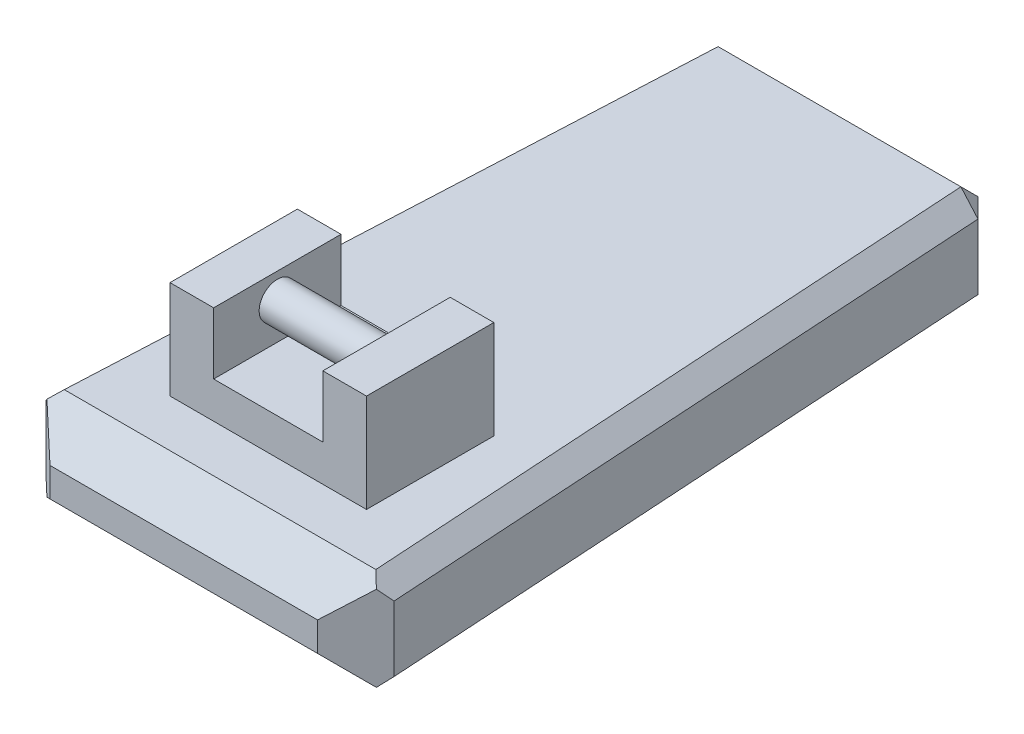
ISO-10303-21;
HEADER;
FILE_DESCRIPTION(('STEP AP214'),'2;1');
FILE_NAME('part.step','',(''),(''),'','','');
FILE_SCHEMA(('AUTOMOTIVE_DESIGN { 1 0 10303 214 1 1 1 1 }'));
ENDSEC;
DATA;
#1=APPLICATION_CONTEXT('core data for automotive mechanical design processes');
#2=APPLICATION_PROTOCOL_DEFINITION('international standard','automotive_design',2000,#1);
#3=PRODUCT_CONTEXT('',#1,'mechanical');
#4=PRODUCT('Part','Part','',(#3));
#5=PRODUCT_RELATED_PRODUCT_CATEGORY('part','',(#4));
#6=PRODUCT_DEFINITION_FORMATION('','',#4);
#7=PRODUCT_DEFINITION_CONTEXT('part definition',#1,'design');
#8=PRODUCT_DEFINITION('design','',#6,#7);
#9=PRODUCT_DEFINITION_SHAPE('','',#8);
#10=(LENGTH_UNIT() NAMED_UNIT(*) SI_UNIT(.MILLI.,.METRE.));
#11=(NAMED_UNIT(*) PLANE_ANGLE_UNIT() SI_UNIT($,.RADIAN.));
#12=(NAMED_UNIT(*) SI_UNIT($,.STERADIAN.) SOLID_ANGLE_UNIT());
#13=UNCERTAINTY_MEASURE_WITH_UNIT(LENGTH_MEASURE(1.E-05),#10,'distance_accuracy_value','');
#14=(GEOMETRIC_REPRESENTATION_CONTEXT(3) GLOBAL_UNCERTAINTY_ASSIGNED_CONTEXT((#13)) GLOBAL_UNIT_ASSIGNED_CONTEXT((#10,
#11,#12)) REPRESENTATION_CONTEXT('',''));
#15=CARTESIAN_POINT('',(0.,0.,0.));
#16=DIRECTION('',(0.,0.,1.));
#17=DIRECTION('',(1.,0.,0.));
#18=AXIS2_PLACEMENT_3D('',#15,#16,#17);
#19=CARTESIAN_POINT('',(27.,35.9415584415584,35.));
#20=DIRECTION('',(-1.,0.,0.));
#21=DIRECTION('',(0.,-1.,0.));
#22=AXIS2_PLACEMENT_3D('',#19,#20,#21);
#23=PLANE('',#22);
#24=DIRECTION('',(0.,1.,0.));
#25=VECTOR('',#24,1.);
#26=CARTESIAN_POINT('',(27.,35.9415584415584,35.));
#27=LINE('',#26,#25);
#28=CARTESIAN_POINT('',(27.,8.94487643859495,35.));
#29=VERTEX_POINT('',#28);
#30=CARTESIAN_POINT('',(27.,35.9415584415584,35.));
#31=VERTEX_POINT('',#30);
#32=EDGE_CURVE('E214',#29,#31,#27,.T.);
#33=ORIENTED_EDGE('',*,*,#32,.F.);
#34=DIRECTION('',(0.,0.,-1.));
#35=VECTOR('',#34,1.);
#36=CARTESIAN_POINT('',(27.,8.94487643859495,35.));
#37=LINE('',#36,#35);
#38=CARTESIAN_POINT('',(27.,8.94487643859495,0.));
#39=VERTEX_POINT('',#38);
#40=EDGE_CURVE('E198',#29,#39,#37,.T.);
#41=ORIENTED_EDGE('',*,*,#40,.T.);
#42=DIRECTION('',(0.,1.,0.));
#43=VECTOR('',#42,1.);
#44=CARTESIAN_POINT('',(27.,35.9415584415584,0.));
#45=LINE('',#44,#43);
#46=CARTESIAN_POINT('',(27.,35.9415584415584,0.));
#47=VERTEX_POINT('',#46);
#48=EDGE_CURVE('E212',#39,#47,#45,.T.);
#49=ORIENTED_EDGE('',*,*,#48,.T.);
#50=DIRECTION('',(0.,0.,-1.));
#51=VECTOR('',#50,1.);
#52=CARTESIAN_POINT('',(27.,35.9415584415584,35.));
#53=LINE('',#52,#51);
#54=EDGE_CURVE('E253',#31,#47,#53,.T.);
#55=ORIENTED_EDGE('',*,*,#54,.F.);
#56=EDGE_LOOP('',(#33,#41,#49,#55));
#57=FACE_BOUND('',#56,.T.);
#58=ADVANCED_FACE('F37',(#57),#23,.F.);
#59=CARTESIAN_POINT('',(15.,35.9415584415584,35.));
#60=DIRECTION('',(0.,-1.,0.));
#61=DIRECTION('',(0.,0.,-1.));
#62=AXIS2_PLACEMENT_3D('',#59,#60,#61);
#63=PLANE('',#62);
#64=DIRECTION('',(-1.,0.,0.));
#65=VECTOR('',#64,1.);
#66=CARTESIAN_POINT('',(15.,35.9415584415584,0.));
#67=LINE('',#66,#65);
#68=CARTESIAN_POINT('',(15.,35.9415584415584,0.));
#69=VERTEX_POINT('',#68);
#70=EDGE_CURVE('E220',#47,#69,#67,.T.);
#71=ORIENTED_EDGE('',*,*,#70,.T.);
#72=DIRECTION('',(0.,0.,-1.));
#73=VECTOR('',#72,1.);
#74=CARTESIAN_POINT('',(15.,35.9415584415584,35.));
#75=LINE('',#74,#73);
#76=CARTESIAN_POINT('',(15.,35.9415584415584,35.));
#77=VERTEX_POINT('',#76);
#78=EDGE_CURVE('E250',#77,#69,#75,.T.);
#79=ORIENTED_EDGE('',*,*,#78,.F.);
#80=DIRECTION('',(-1.,0.,0.));
#81=VECTOR('',#80,1.);
#82=CARTESIAN_POINT('',(15.,35.9415584415584,35.));
#83=LINE('',#82,#81);
#84=EDGE_CURVE('E787',#31,#77,#83,.T.);
#85=ORIENTED_EDGE('',*,*,#84,.F.);
#86=ORIENTED_EDGE('',*,*,#54,.T.);
#87=EDGE_LOOP('',(#71,#79,#85,#86));
#88=FACE_BOUND('',#87,.T.);
#89=ADVANCED_FACE('F483',(#88),#63,.F.);
#90=CARTESIAN_POINT('',(15.,18.9935064935065,35.));
#91=DIRECTION('',(1.,0.,0.));
#92=DIRECTION('',(0.,0.,-1.));
#93=AXIS2_PLACEMENT_3D('',#90,#91,#92);
#94=PLANE('',#93);
#95=CARTESIAN_POINT('',(15.,28.9803110876899,17.5));
#96=DIRECTION('',(1.,0.,0.));
#97=DIRECTION('',(0.,0.,-1.));
#98=AXIS2_PLACEMENT_3D('',#95,#96,#97);
#99=CIRCLE('',#98,5.);
#100=CARTESIAN_POINT('',(15.,28.9803110876899,12.5));
#101=VERTEX_POINT('',#100);
#102=EDGE_CURVE('E207',#101,#101,#99,.F.);
#103=ORIENTED_EDGE('',*,*,#102,.F.);
#104=EDGE_LOOP('',(#103));
#105=FACE_BOUND('',#104,.T.);
#106=DIRECTION('',(0.,-1.,0.));
#107=VECTOR('',#106,1.);
#108=CARTESIAN_POINT('',(15.,18.9935064935065,0.));
#109=LINE('',#108,#107);
#110=CARTESIAN_POINT('',(15.,18.9935064935065,0.));
#111=VERTEX_POINT('',#110);
#112=EDGE_CURVE('E222',#69,#111,#109,.T.);
#113=ORIENTED_EDGE('',*,*,#112,.T.);
#114=DIRECTION('',(0.,0.,-1.));
#115=VECTOR('',#114,1.);
#116=CARTESIAN_POINT('',(15.,18.9935064935065,35.));
#117=LINE('',#116,#115);
#118=CARTESIAN_POINT('',(15.,18.9935064935065,35.));
#119=VERTEX_POINT('',#118);
#120=EDGE_CURVE('E247',#119,#111,#117,.T.);
#121=ORIENTED_EDGE('',*,*,#120,.F.);
#122=DIRECTION('',(0.,-1.,0.));
#123=VECTOR('',#122,1.);
#124=CARTESIAN_POINT('',(15.,18.9935064935065,35.));
#125=LINE('',#124,#123);
#126=EDGE_CURVE('E785',#77,#119,#125,.T.);
#127=ORIENTED_EDGE('',*,*,#126,.F.);
#128=ORIENTED_EDGE('',*,*,#78,.T.);
#129=EDGE_LOOP('',(#113,#121,#127,#128));
#130=FACE_BOUND('',#129,.T.);
#131=ADVANCED_FACE('F488',(#105,#130),#94,.F.);
#132=CARTESIAN_POINT('',(-15.,18.9935064935065,35.));
#133=DIRECTION('',(0.,-1.,0.));
#134=DIRECTION('',(0.,0.,-1.));
#135=AXIS2_PLACEMENT_3D('',#132,#133,#134);
#136=PLANE('',#135);
#137=DIRECTION('',(-1.,0.,0.));
#138=VECTOR('',#137,1.);
#139=CARTESIAN_POINT('',(-15.,18.9935064935065,0.));
#140=LINE('',#139,#138);
#141=CARTESIAN_POINT('',(-15.,18.9935064935065,0.));
#142=VERTEX_POINT('',#141);
#143=EDGE_CURVE('E230',#111,#142,#140,.T.);
#144=ORIENTED_EDGE('',*,*,#143,.T.);
#145=DIRECTION('',(0.,0.,-1.));
#146=VECTOR('',#145,1.);
#147=CARTESIAN_POINT('',(-15.,18.9935064935065,35.));
#148=LINE('',#147,#146);
#149=CARTESIAN_POINT('',(-15.,18.9935064935065,35.));
#150=VERTEX_POINT('',#149);
#151=EDGE_CURVE('E244',#150,#142,#148,.T.);
#152=ORIENTED_EDGE('',*,*,#151,.F.);
#153=DIRECTION('',(-1.,0.,0.));
#154=VECTOR('',#153,1.);
#155=CARTESIAN_POINT('',(-15.,18.9935064935065,35.));
#156=LINE('',#155,#154);
#157=EDGE_CURVE('E770',#119,#150,#156,.T.);
#158=ORIENTED_EDGE('',*,*,#157,.F.);
#159=ORIENTED_EDGE('',*,*,#120,.T.);
#160=EDGE_LOOP('',(#144,#152,#158,#159));
#161=FACE_BOUND('',#160,.T.);
#162=ADVANCED_FACE('F722',(#161),#136,.F.);
#163=CARTESIAN_POINT('',(-15.,18.9935064935065,35.));
#164=DIRECTION('',(-1.,0.,0.));
#165=DIRECTION('',(0.,0.,1.));
#166=AXIS2_PLACEMENT_3D('',#163,#164,#165);
#167=PLANE('',#166);
#168=CARTESIAN_POINT('',(-15.,28.9803110876899,17.5));
#169=DIRECTION('',(-1.,0.,0.));
#170=DIRECTION('',(0.,0.,1.));
#171=AXIS2_PLACEMENT_3D('',#168,#169,#170);
#172=CIRCLE('',#171,5.);
#173=CARTESIAN_POINT('',(-15.,28.9803110876899,22.5));
#174=VERTEX_POINT('',#173);
#175=EDGE_CURVE('E255',#174,#174,#172,.F.);
#176=ORIENTED_EDGE('',*,*,#175,.F.);
#177=EDGE_LOOP('',(#176));
#178=FACE_BOUND('',#177,.T.);
#179=DIRECTION('',(0.,1.,0.));
#180=VECTOR('',#179,1.);
#181=CARTESIAN_POINT('',(-15.,18.9935064935065,0.));
#182=LINE('',#181,#180);
#183=CARTESIAN_POINT('',(-15.,35.9415584415584,0.));
#184=VERTEX_POINT('',#183);
#185=EDGE_CURVE('E232',#142,#184,#182,.T.);
#186=ORIENTED_EDGE('',*,*,#185,.T.);
#187=DIRECTION('',(0.,0.,-1.));
#188=VECTOR('',#187,1.);
#189=CARTESIAN_POINT('',(-15.,35.9415584415584,35.));
#190=LINE('',#189,#188);
#191=CARTESIAN_POINT('',(-15.,35.9415584415584,35.));
#192=VERTEX_POINT('',#191);
#193=EDGE_CURVE('E241',#192,#184,#190,.T.);
#194=ORIENTED_EDGE('',*,*,#193,.F.);
#195=DIRECTION('',(0.,1.,0.));
#196=VECTOR('',#195,1.);
#197=CARTESIAN_POINT('',(-15.,18.9935064935065,35.));
#198=LINE('',#197,#196);
#199=EDGE_CURVE('E781',#150,#192,#198,.T.);
#200=ORIENTED_EDGE('',*,*,#199,.F.);
#201=ORIENTED_EDGE('',*,*,#151,.T.);
#202=EDGE_LOOP('',(#186,#194,#200,#201));
#203=FACE_BOUND('',#202,.T.);
#204=ADVANCED_FACE('F712',(#178,#203),#167,.F.);
#205=CARTESIAN_POINT('',(-15.,35.9415584415584,35.));
#206=DIRECTION('',(0.,-1.,0.));
#207=DIRECTION('',(0.,0.,-1.));
#208=AXIS2_PLACEMENT_3D('',#205,#206,#207);
#209=PLANE('',#208);
#210=DIRECTION('',(-1.,0.,0.));
#211=VECTOR('',#210,1.);
#212=CARTESIAN_POINT('',(-15.,35.9415584415584,0.));
#213=LINE('',#212,#211);
#214=CARTESIAN_POINT('',(-27.,35.9415584415584,0.));
#215=VERTEX_POINT('',#214);
#216=EDGE_CURVE('E234',#184,#215,#213,.T.);
#217=ORIENTED_EDGE('',*,*,#216,.T.);
#218=DIRECTION('',(0.,0.,-1.));
#219=VECTOR('',#218,1.);
#220=CARTESIAN_POINT('',(-27.,35.9415584415584,35.));
#221=LINE('',#220,#219);
#222=CARTESIAN_POINT('',(-27.,35.9415584415584,35.));
#223=VERTEX_POINT('',#222);
#224=EDGE_CURVE('E238',#223,#215,#221,.T.);
#225=ORIENTED_EDGE('',*,*,#224,.F.);
#226=DIRECTION('',(-1.,0.,0.));
#227=VECTOR('',#226,1.);
#228=CARTESIAN_POINT('',(-15.,35.9415584415584,35.));
#229=LINE('',#228,#227);
#230=EDGE_CURVE('E778',#192,#223,#229,.T.);
#231=ORIENTED_EDGE('',*,*,#230,.F.);
#232=ORIENTED_EDGE('',*,*,#193,.T.);
#233=EDGE_LOOP('',(#217,#225,#231,#232));
#234=FACE_BOUND('',#233,.T.);
#235=ADVANCED_FACE('F703',(#234),#209,.F.);
#236=CARTESIAN_POINT('',(-27.,35.9415584415584,35.));
#237=DIRECTION('',(1.,0.,0.));
#238=DIRECTION('',(0.,1.,0.));
#239=AXIS2_PLACEMENT_3D('',#236,#237,#238);
#240=PLANE('',#239);
#241=DIRECTION('',(0.,-1.,0.));
#242=VECTOR('',#241,1.);
#243=CARTESIAN_POINT('',(-27.,35.9415584415584,0.));
#244=LINE('',#243,#242);
#245=CARTESIAN_POINT('',(-27.,8.94487643859495,0.));
#246=VERTEX_POINT('',#245);
#247=EDGE_CURVE('E236',#215,#246,#244,.T.);
#248=ORIENTED_EDGE('',*,*,#247,.T.);
#249=DIRECTION('',(0.,0.,1.));
#250=VECTOR('',#249,1.);
#251=CARTESIAN_POINT('',(-27.,8.94487643859495,35.));
#252=LINE('',#251,#250);
#253=CARTESIAN_POINT('',(-27.,8.94487643859495,35.));
#254=VERTEX_POINT('',#253);
#255=EDGE_CURVE('E201',#246,#254,#252,.T.);
#256=ORIENTED_EDGE('',*,*,#255,.T.);
#257=DIRECTION('',(0.,-1.,0.));
#258=VECTOR('',#257,1.);
#259=CARTESIAN_POINT('',(-27.,35.9415584415584,35.));
#260=LINE('',#259,#258);
#261=EDGE_CURVE('E226',#223,#254,#260,.T.);
#262=ORIENTED_EDGE('',*,*,#261,.F.);
#263=ORIENTED_EDGE('',*,*,#224,.T.);
#264=EDGE_LOOP('',(#248,#256,#262,#263));
#265=FACE_BOUND('',#264,.T.);
#266=ADVANCED_FACE('F694',(#265),#240,.F.);
#267=CARTESIAN_POINT('',(0.,0.,35.));
#268=DIRECTION('',(0.,0.,1.));
#269=DIRECTION('',(1.,0.,0.));
#270=AXIS2_PLACEMENT_3D('',#267,#268,#269);
#271=PLANE('',#270);
#272=DIRECTION('',(-1.,0.,0.));
#273=VECTOR('',#272,1.);
#274=CARTESIAN_POINT('',(0.,8.94487643859495,35.));
#275=LINE('',#274,#273);
#276=EDGE_CURVE('E215',#29,#254,#275,.T.);
#277=ORIENTED_EDGE('',*,*,#276,.F.);
#278=ORIENTED_EDGE('',*,*,#32,.T.);
#279=ORIENTED_EDGE('',*,*,#84,.T.);
#280=ORIENTED_EDGE('',*,*,#126,.T.);
#281=ORIENTED_EDGE('',*,*,#157,.T.);
#282=ORIENTED_EDGE('',*,*,#199,.T.);
#283=ORIENTED_EDGE('',*,*,#230,.T.);
#284=ORIENTED_EDGE('',*,*,#261,.T.);
#285=EDGE_LOOP('',(#277,#278,#279,#280,#281,#282,#283,#284));
#286=FACE_BOUND('',#285,.T.);
#287=ADVANCED_FACE('F686',(#286),#271,.T.);
#288=CARTESIAN_POINT('',(0.,0.,0.));
#289=DIRECTION('',(0.,0.,1.));
#290=DIRECTION('',(1.,0.,0.));
#291=AXIS2_PLACEMENT_3D('',#288,#289,#290);
#292=PLANE('',#291);
#293=ORIENTED_EDGE('',*,*,#48,.F.);
#294=DIRECTION('',(-1.,0.,0.));
#295=VECTOR('',#294,1.);
#296=CARTESIAN_POINT('',(0.,8.94487643859495,0.));
#297=LINE('',#296,#295);
#298=EDGE_CURVE('E195',#39,#246,#297,.T.);
#299=ORIENTED_EDGE('',*,*,#298,.T.);
#300=ORIENTED_EDGE('',*,*,#247,.F.);
#301=ORIENTED_EDGE('',*,*,#216,.F.);
#302=ORIENTED_EDGE('',*,*,#185,.F.);
#303=ORIENTED_EDGE('',*,*,#143,.F.);
#304=ORIENTED_EDGE('',*,*,#112,.F.);
#305=ORIENTED_EDGE('',*,*,#70,.F.);
#306=EDGE_LOOP('',(#293,#299,#300,#301,#302,#303,#304,#305));
#307=FACE_BOUND('',#306,.T.);
#308=ADVANCED_FACE('F218',(#307),#292,.F.);
#309=CARTESIAN_POINT('',(20.,28.9803110876899,17.5));
#310=DIRECTION('',(-1.,0.,0.));
#311=DIRECTION('',(0.,0.,1.));
#312=AXIS2_PLACEMENT_3D('',#309,#310,#311);
#313=CYLINDRICAL_SURFACE('',#312,5.);
#314=ORIENTED_EDGE('',*,*,#175,.T.);
#315=EDGE_LOOP('',(#314));
#316=FACE_BOUND('',#315,.T.);
#317=ORIENTED_EDGE('',*,*,#102,.T.);
#318=EDGE_LOOP('',(#317));
#319=FACE_BOUND('',#318,.T.);
#320=ADVANCED_FACE('F670',(#316,#319),#313,.T.);
#321=CARTESIAN_POINT('',(52.6007233275502,-19.0370940272118,58.));
#322=DIRECTION('',(0.,-1.,0.));
#323=DIRECTION('',(0.,0.,-1.));
#324=AXIS2_PLACEMENT_3D('',#321,#322,#323);
#325=PLANE('',#324);
#326=DIRECTION('',(1.,0.,0.));
#327=VECTOR('',#326,1.);
#328=CARTESIAN_POINT('',(36.5697571220703,-19.0370940272118,-123.472786639216));
#329=LINE('',#328,#327);
#330=CARTESIAN_POINT('',(-34.8507689927314,-19.0370940272118,-123.472786639216));
#331=VERTEX_POINT('',#330);
#332=CARTESIAN_POINT('',(31.8718862353731,-19.0370940272118,-123.472786639216));
#333=VERTEX_POINT('',#332);
#334=EDGE_CURVE('E318',#331,#333,#329,.T.);
#335=ORIENTED_EDGE('',*,*,#334,.T.);
#336=DIRECTION('',(0.0622479222512534,0.,0.998060717679742));
#337=VECTOR('',#336,1.);
#338=CARTESIAN_POINT('',(42.5858623699172,-19.0370940272118,48.3112396112563));
#339=LINE('',#338,#337);
#340=CARTESIAN_POINT('',(42.5664507060978,-19.0370940272118,48.));
#341=VERTEX_POINT('',#340);
#342=EDGE_CURVE('E320',#333,#341,#339,.T.);
#343=ORIENTED_EDGE('',*,*,#342,.T.);
#344=DIRECTION('',(-1.,0.,0.));
#345=VECTOR('',#344,1.);
#346=CARTESIAN_POINT('',(-47.5406842586914,-19.0370940272118,48.));
#347=LINE('',#346,#345);
#348=CARTESIAN_POINT('',(-43.0558460636915,-19.0370940272118,48.));
#349=VERTEX_POINT('',#348);
#350=EDGE_CURVE('E270',#341,#349,#347,.T.);
#351=ORIENTED_EDGE('',*,*,#350,.T.);
#352=DIRECTION('',(0.0477959204418131,0.,-0.998857121909395));
#353=VECTOR('',#352,1.);
#354=CARTESIAN_POINT('',(-34.6229512726959,-19.0370940272118,-128.233807037007));
#355=LINE('',#354,#353);
#356=EDGE_CURVE('E316',#349,#331,#355,.T.);
#357=ORIENTED_EDGE('',*,*,#356,.T.);
#358=EDGE_LOOP('',(#335,#343,#351,#357));
#359=FACE_BOUND('',#358,.T.);
#360=ADVANCED_FACE('F394',(#359),#325,.T.);
#361=CARTESIAN_POINT('',(52.6007233275502,8.94487643859495,58.));
#362=DIRECTION('',(0.,1.,0.));
#363=DIRECTION('',(0.,0.,1.));
#364=AXIS2_PLACEMENT_3D('',#361,#362,#363);
#365=PLANE('',#364);
#366=DIRECTION('',(1.,0.,0.));
#367=VECTOR('',#366,1.);
#368=CARTESIAN_POINT('',(47.0835622946655,8.94487643859495,48.));
#369=LINE('',#368,#367);
#370=CARTESIAN_POINT('',(-43.0558460636915,8.94487643859495,48.));
#371=VERTEX_POINT('',#370);
#372=CARTESIAN_POINT('',(42.5664507060978,8.94487643859495,48.));
#373=VERTEX_POINT('',#372);
#374=EDGE_CURVE('E276',#371,#373,#369,.T.);
#375=ORIENTED_EDGE('',*,*,#374,.T.);
#376=DIRECTION('',(-0.0622479222512534,0.,-0.998060717679742));
#377=VECTOR('',#376,1.);
#378=CARTESIAN_POINT('',(31.5794535336716,8.94487643859495,-128.16154702796));
#379=LINE('',#378,#377);
#380=CARTESIAN_POINT('',(31.8718862353732,8.94487643859495,-123.472786639216));
#381=VERTEX_POINT('',#380);
#382=EDGE_CURVE('E11',#373,#381,#379,.T.);
#383=ORIENTED_EDGE('',*,*,#382,.T.);
#384=DIRECTION('',(-1.,0.,0.));
#385=VECTOR('',#384,1.);
#386=CARTESIAN_POINT('',(-39.6172368822429,8.94487643859495,-123.472786639216));
#387=LINE('',#386,#385);
#388=CARTESIAN_POINT('',(-34.8507689927314,8.94487643859495,-123.472786639216));
#389=VERTEX_POINT('',#388);
#390=EDGE_CURVE('E46',#381,#389,#387,.T.);
#391=ORIENTED_EDGE('',*,*,#390,.T.);
#392=DIRECTION('',(-0.0477959204418131,0.,0.998857121909395));
#393=VECTOR('',#392,1.);
#394=CARTESIAN_POINT('',(-43.0672813829217,8.94487643859495,48.2389796022091));
#395=LINE('',#394,#393);
#396=EDGE_CURVE('E346',#389,#371,#395,.T.);
#397=ORIENTED_EDGE('',*,*,#396,.T.);
#398=EDGE_LOOP('',(#375,#383,#391,#397));
#399=FACE_BOUND('',#398,.T.);
#400=ORIENTED_EDGE('',*,*,#40,.F.);
#401=ORIENTED_EDGE('',*,*,#276,.T.);
#402=ORIENTED_EDGE('',*,*,#255,.F.);
#403=ORIENTED_EDGE('',*,*,#298,.F.);
#404=EDGE_LOOP('',(#400,#401,#402,#403));
#405=FACE_BOUND('',#404,.T.);
#406=ADVANCED_FACE('F197',(#399,#405),#365,.T.);
#407=CARTESIAN_POINT('',(0.,0.,58.));
#408=DIRECTION('',(0.,0.,-1.));
#409=DIRECTION('',(-1.,0.,0.));
#410=AXIS2_PLACEMENT_3D('',#407,#408,#409);
#411=PLANE('',#410);
#412=DIRECTION('',(1.,0.,0.));
#413=VECTOR('',#412,1.);
#414=CARTESIAN_POINT('',(47.0835622946655,-9.03709402721181,58.));
#415=LINE('',#414,#413);
#416=CARTESIAN_POINT('',(-36.9768770279031,-9.03709402721181,58.));
#417=VERTEX_POINT('',#416);
#418=CARTESIAN_POINT('',(36.552681690978,-9.03709402721181,58.));
#419=VERTEX_POINT('',#418);
#420=EDGE_CURVE('E262',#417,#419,#415,.T.);
#421=ORIENTED_EDGE('',*,*,#420,.T.);
#422=DIRECTION('',(0.,1.,0.));
#423=VECTOR('',#422,1.);
#424=CARTESIAN_POINT('',(36.552681690978,0.,58.));
#425=LINE('',#424,#423);
#426=CARTESIAN_POINT('',(36.552681690978,-1.05512356140506,58.));
#427=VERTEX_POINT('',#426);
#428=EDGE_CURVE('E264',#419,#427,#425,.T.);
#429=ORIENTED_EDGE('',*,*,#428,.T.);
#430=DIRECTION('',(-1.,0.,0.));
#431=VECTOR('',#430,1.);
#432=CARTESIAN_POINT('',(-47.5406842586914,-1.05512356140506,58.));
#433=LINE('',#432,#431);
#434=CARTESIAN_POINT('',(-36.9768770279031,-1.05512356140506,58.));
#435=VERTEX_POINT('',#434);
#436=EDGE_CURVE('E206',#427,#435,#433,.T.);
#437=ORIENTED_EDGE('',*,*,#436,.T.);
#438=DIRECTION('',(0.,-1.,0.));
#439=VECTOR('',#438,1.);
#440=CARTESIAN_POINT('',(-36.9768770279031,0.,58.));
#441=LINE('',#440,#439);
#442=EDGE_CURVE('E260',#435,#417,#441,.T.);
#443=ORIENTED_EDGE('',*,*,#442,.T.);
#444=EDGE_LOOP('',(#421,#429,#437,#443));
#445=FACE_BOUND('',#444,.T.);
#446=ADVANCED_FACE('F416',(#445),#411,.F.);
#447=CARTESIAN_POINT('',(52.6007233275502,-157.055123561405,-54.));
#448=DIRECTION('',(-0.998788911812763,0.,-0.0492007077172383));
#449=DIRECTION('',(-0.0492007077172383,0.,0.998788911812763));
#450=AXIS2_PLACEMENT_3D('',#447,#448,#449);
#451=PLANE('',#450);
#452=DIRECTION('',(0.,-1.,0.));
#453=VECTOR('',#452,1.);
#454=CARTESIAN_POINT('',(47.5755693718379,-157.055123561405,48.0121108818724));
#455=LINE('',#454,#453);
#456=CARTESIAN_POINT('',(47.5755693718379,3.94622574535658,48.0121108818724));
#457=VERTEX_POINT('',#456);
#458=CARTESIAN_POINT('',(47.5755693718379,-14.0384433339734,48.0121108818724));
#459=VERTEX_POINT('',#458);
#460=EDGE_CURVE('E267',#457,#459,#455,.T.);
#461=ORIENTED_EDGE('',*,*,#460,.T.);
#462=DIRECTION('',(0.0488988877091493,0.110595198266023,-0.992661876421829));
#463=VECTOR('',#462,1.);
#464=CARTESIAN_POINT('',(50.0329630743904,-8.48052665153289,-1.87370775662603));
#465=LINE('',#464,#463);
#466=CARTESIAN_POINT('',(47.576165958316,-14.0370940272118,48.0000000000001));
#467=VERTEX_POINT('',#466);
#468=EDGE_CURVE('E332',#459,#467,#465,.T.);
#469=ORIENTED_EDGE('',*,*,#468,.T.);
#470=DIRECTION('',(0.,1.,0.));
#471=VECTOR('',#470,1.);
#472=CARTESIAN_POINT('',(47.576165958316,-157.055123561405,48.0000000000001));
#473=LINE('',#472,#471);
#474=CARTESIAN_POINT('',(47.576165958316,3.94487643859498,48.0000000000001));
#475=VERTEX_POINT('',#474);
#476=EDGE_CURVE('E291',#467,#475,#473,.T.);
#477=ORIENTED_EDGE('',*,*,#476,.T.);
#478=DIRECTION('',(-0.0488988877091493,0.110595198266023,0.992661876421829));
#479=VECTOR('',#478,1.);
#480=CARTESIAN_POINT('',(50.0329630743904,-1.61169093708394,-1.87370775662603));
#481=LINE('',#480,#479);
#482=EDGE_CURVE('E330',#475,#457,#481,.T.);
#483=ORIENTED_EDGE('',*,*,#482,.T.);
#484=EDGE_LOOP('',(#461,#469,#477,#483));
#485=FACE_BOUND('',#484,.T.);
#486=ADVANCED_FACE('F466',(#485),#451,.F.);
#487=CARTESIAN_POINT('',(-47.5406842586914,-157.055123561405,58.));
#488=DIRECTION('',(0.998646160182909,0.,-0.0520177541992306));
#489=DIRECTION('',(-0.0520177541992306,0.,-0.998646160182909));
#490=AXIS2_PLACEMENT_3D('',#487,#488,#489);
#491=PLANE('',#490);
#492=DIRECTION('',(0.,-1.,0.));
#493=VECTOR('',#492,1.);
#494=CARTESIAN_POINT('',(-48.0615669924687,-157.055123561405,48.));
#495=LINE('',#494,#493);
#496=CARTESIAN_POINT('',(-48.0615669924687,3.94487643859498,48.));
#497=VERTEX_POINT('',#496);
#498=CARTESIAN_POINT('',(-48.0615669924687,-14.0370940272118,48.));
#499=VERTEX_POINT('',#498);
#500=EDGE_CURVE('E278',#497,#499,#495,.T.);
#501=ORIENTED_EDGE('',*,*,#500,.T.);
#502=DIRECTION('',(0.0517611887203937,-0.0991978213053763,0.993720570175801));
#503=VECTOR('',#502,1.);
#504=CARTESIAN_POINT('',(-50.6364499666509,-9.10245501544306,-1.43306443486201));
#505=LINE('',#504,#503);
#506=CARTESIAN_POINT('',(-48.0608618006837,-14.0384454932505,48.0135383981709));
#507=VERTEX_POINT('',#506);
#508=EDGE_CURVE('E336',#499,#507,#505,.T.);
#509=ORIENTED_EDGE('',*,*,#508,.T.);
#510=DIRECTION('',(0.,1.,0.));
#511=VECTOR('',#510,1.);
#512=CARTESIAN_POINT('',(-48.0608618006837,-157.055123561405,48.0135383981709));
#513=LINE('',#512,#511);
#514=CARTESIAN_POINT('',(-48.0608618006837,3.94622790463364,48.0135383981709));
#515=VERTEX_POINT('',#514);
#516=EDGE_CURVE('E273',#507,#515,#513,.T.);
#517=ORIENTED_EDGE('',*,*,#516,.T.);
#518=DIRECTION('',(-0.0517611887203937,-0.0991978213053762,-0.993720570175801));
#519=VECTOR('',#518,1.);
#520=CARTESIAN_POINT('',(-50.6364499666509,-0.989762573173764,-1.43306443486201));
#521=LINE('',#520,#519);
#522=EDGE_CURVE('E334',#515,#497,#521,.T.);
#523=ORIENTED_EDGE('',*,*,#522,.T.);
#524=EDGE_LOOP('',(#501,#509,#517,#523));
#525=FACE_BOUND('',#524,.T.);
#526=ADVANCED_FACE('F430',(#525),#491,.F.);
#527=CARTESIAN_POINT('',(-36.9768770279031,0.,58.));
#528=DIRECTION('',(0.669367365134873,0.,-0.742931578607611));
#529=DIRECTION('',(0.,-1.,0.));
#530=AXIS2_PLACEMENT_3D('',#527,#528,#529);
#531=PLANE('',#530);
#532=ORIENTED_EDGE('',*,*,#516,.F.);
#533=DIRECTION('',(-0.587487173336424,0.612114839132101,-0.529314882541065));
#534=VECTOR('',#533,1.);
#535=CARTESIAN_POINT('',(-46.1782351675235,-15.9999924869629,49.7097495503916));
#536=LINE('',#535,#534);
#537=CARTESIAN_POINT('',(-45.4950548948032,-16.7118119133506,50.3252821138613));
#538=VERTEX_POINT('',#537);
#539=EDGE_CURVE('E340',#507,#538,#536,.F.);
#540=ORIENTED_EDGE('',*,*,#539,.T.);
#541=DIRECTION('',(-0.617385804138295,-0.556252985991317,-0.556252985991315));
#542=VECTOR('',#541,1.);
#543=CARTESIAN_POINT('',(-33.873333823488,-6.24086003051587,60.796233996696));
#544=LINE('',#543,#542);
#545=EDGE_CURVE('E286',#417,#538,#544,.T.);
#546=ORIENTED_EDGE('',*,*,#545,.F.);
#547=ORIENTED_EDGE('',*,*,#442,.F.);
#548=DIRECTION('',(-0.617385804138295,0.556252985991317,-0.556252985991315));
#549=VECTOR('',#548,1.);
#550=CARTESIAN_POINT('',(-9.70146422363249,-25.6297569832042,82.5746334217991));
#551=LINE('',#550,#549);
#552=CARTESIAN_POINT('',(-45.4950548948032,6.6195943247337,50.3252821138613));
#553=VERTEX_POINT('',#552);
#554=EDGE_CURVE('E284',#553,#435,#551,.F.);
#555=ORIENTED_EDGE('',*,*,#554,.F.);
#556=DIRECTION('',(0.587487173336424,0.6121148391321,0.529314882541066));
#557=VECTOR('',#556,1.);
#558=CARTESIAN_POINT('',(-42.5489766698473,9.68917316932027,52.9796431286614));
#559=LINE('',#558,#557);
#560=EDGE_CURVE('E338',#553,#515,#559,.F.);
#561=ORIENTED_EDGE('',*,*,#560,.T.);
#562=EDGE_LOOP('',(#532,#540,#546,#547,#555,#561));
#563=FACE_BOUND('',#562,.T.);
#564=ADVANCED_FACE('F472',(#563),#531,.F.);
#565=CARTESIAN_POINT('',(52.6007233275502,-19.0370940272118,48.));
#566=DIRECTION('',(0.,-0.707106781186546,0.707106781186548));
#567=DIRECTION('',(1.,0.,0.));
#568=AXIS2_PLACEMENT_3D('',#565,#566,#567);
#569=PLANE('',#568);
#570=ORIENTED_EDGE('',*,*,#350,.F.);
#571=DIRECTION('',(0.601319619658374,0.564984386958573,0.564984386958572));
#572=VECTOR('',#571,1.);
#573=CARTESIAN_POINT('',(46.1946960315538,-15.6280884103609,51.409005616851));
#574=LINE('',#573,#572);
#575=CARTESIAN_POINT('',(45.0321540431219,-16.7203828427643,50.3167111844476));
#576=VERTEX_POINT('',#575);
#577=EDGE_CURVE('E324',#341,#576,#574,.T.);
#578=ORIENTED_EDGE('',*,*,#577,.T.);
#579=DIRECTION('',(0.615218515173656,-0.557452320197667,-0.557452320197665));
#580=VECTOR('',#579,1.);
#581=CARTESIAN_POINT('',(49.4858660704331,-20.7559117514093,46.2811822758026));
#582=LINE('',#581,#580);
#583=EDGE_CURVE('E281',#419,#576,#582,.T.);
#584=ORIENTED_EDGE('',*,*,#583,.F.);
#585=ORIENTED_EDGE('',*,*,#420,.F.);
#586=ORIENTED_EDGE('',*,*,#545,.T.);
#587=DIRECTION('',(0.595751526179241,-0.567926103932152,-0.56792610393215));
#588=VECTOR('',#587,1.);
#589=CARTESIAN_POINT('',(-9.10542784375486,-51.4018096833739,15.635284343838));
#590=LINE('',#589,#588);
#591=EDGE_CURVE('E322',#538,#349,#590,.T.);
#592=ORIENTED_EDGE('',*,*,#591,.T.);
#593=EDGE_LOOP('',(#570,#578,#584,#585,#586,#592));
#594=FACE_BOUND('',#593,.T.);
#595=ADVANCED_FACE('F407',(#594),#569,.T.);
#596=CARTESIAN_POINT('',(52.6007233275502,8.94487643859495,48.));
#597=DIRECTION('',(0.,0.707106781186546,0.707106781186548));
#598=DIRECTION('',(-1.,0.,0.));
#599=AXIS2_PLACEMENT_3D('',#596,#597,#598);
#600=PLANE('',#599);
#601=DIRECTION('',(-0.615218515173656,-0.557452320197667,0.557452320197665));
#602=VECTOR('',#601,1.);
#603=CARTESIAN_POINT('',(49.4858660704331,10.6636941627924,46.2811822758026));
#604=LINE('',#603,#602);
#605=CARTESIAN_POINT('',(45.0321540431219,6.62816525414745,50.3167111844475));
#606=VERTEX_POINT('',#605);
#607=EDGE_CURVE('E279',#606,#427,#604,.T.);
#608=ORIENTED_EDGE('',*,*,#607,.F.);
#609=DIRECTION('',(-0.601319619658375,0.564984386958573,-0.564984386958572));
#610=VECTOR('',#609,1.);
#611=CARTESIAN_POINT('',(46.1946960315538,5.53587082174399,51.409005616851));
#612=LINE('',#611,#610);
#613=EDGE_CURVE('E344',#606,#373,#612,.T.);
#614=ORIENTED_EDGE('',*,*,#613,.T.);
#615=ORIENTED_EDGE('',*,*,#374,.F.);
#616=DIRECTION('',(-0.595751526179242,-0.567926103932151,0.56792610393215));
#617=VECTOR('',#616,1.);
#618=CARTESIAN_POINT('',(-9.10542784375481,41.3095920947571,15.635284343838));
#619=LINE('',#618,#617);
#620=EDGE_CURVE('E342',#371,#553,#619,.T.);
#621=ORIENTED_EDGE('',*,*,#620,.T.);
#622=ORIENTED_EDGE('',*,*,#554,.T.);
#623=ORIENTED_EDGE('',*,*,#436,.F.);
#624=EDGE_LOOP('',(#608,#614,#615,#621,#622,#623));
#625=FACE_BOUND('',#624,.T.);
#626=ADVANCED_FACE('F470',(#625),#600,.T.);
#627=CARTESIAN_POINT('',(36.552681690978,0.,58.));
#628=DIRECTION('',(-0.671460258450701,0.,-0.741040566582773));
#629=DIRECTION('',(0.,1.,0.));
#630=AXIS2_PLACEMENT_3D('',#627,#628,#629);
#631=PLANE('',#630);
#632=ORIENTED_EDGE('',*,*,#583,.T.);
#633=DIRECTION('',(-0.583915395925889,-0.615717673965373,0.529088420178879));
#634=VECTOR('',#633,1.);
#635=CARTESIAN_POINT('',(45.7787492229458,-15.9331252182483,49.6402178654457));
#636=LINE('',#635,#634);
#637=EDGE_CURVE('E328',#576,#459,#636,.F.);
#638=ORIENTED_EDGE('',*,*,#637,.T.);
#639=ORIENTED_EDGE('',*,*,#460,.F.);
#640=DIRECTION('',(0.58391539592589,-0.615717673965373,-0.529088420178879));
#641=VECTOR('',#640,1.);
#642=CARTESIAN_POINT('',(42.1503242135339,9.66695061897649,52.9279504194456));
#643=LINE('',#642,#641);
#644=EDGE_CURVE('E326',#457,#606,#643,.F.);
#645=ORIENTED_EDGE('',*,*,#644,.T.);
#646=ORIENTED_EDGE('',*,*,#607,.T.);
#647=ORIENTED_EDGE('',*,*,#428,.F.);
#648=EDGE_LOOP('',(#632,#638,#639,#645,#646,#647));
#649=FACE_BOUND('',#648,.T.);
#650=ADVANCED_FACE('F411',(#649),#631,.F.);
#651=CARTESIAN_POINT('',(44.4097117626053,-157.055123561405,-2.76978367751598));
#652=DIRECTION('',(-0.998060717679742,0.,0.0622479222512534));
#653=DIRECTION('',(0.0622479222512534,0.,0.998060717679742));
#654=AXIS2_PLACEMENT_3D('',#651,#652,#653);
#655=PLANE('',#654);
#656=ORIENTED_EDGE('',*,*,#476,.F.);
#657=DIRECTION('',(-0.0622479222512534,0.,-0.998060717679742));
#658=VECTOR('',#657,1.);
#659=CARTESIAN_POINT('',(36.5697571220703,-14.0370940272118,-128.472786639216));
#660=LINE('',#659,#658);
#661=CARTESIAN_POINT('',(36.9023445933858,-14.0370940272118,-123.140199167901));
#662=VERTEX_POINT('',#661);
#663=EDGE_CURVE('E299',#467,#662,#660,.T.);
#664=ORIENTED_EDGE('',*,*,#663,.T.);
#665=DIRECTION('',(0.,1.,0.));
#666=VECTOR('',#665,1.);
#667=CARTESIAN_POINT('',(36.9023445933858,-157.055123561405,-123.140199167901));
#668=LINE('',#667,#666);
#669=CARTESIAN_POINT('',(36.9023445933858,3.94487643859498,-123.140199167901));
#670=VERTEX_POINT('',#669);
#671=EDGE_CURVE('E296',#662,#670,#668,.T.);
#672=ORIENTED_EDGE('',*,*,#671,.T.);
#673=DIRECTION('',(0.0622479222512534,0.,0.998060717679742));
#674=VECTOR('',#673,1.);
#675=CARTESIAN_POINT('',(47.576165958316,3.94487643859498,48.));
#676=LINE('',#675,#674);
#677=EDGE_CURVE('E294',#670,#475,#676,.T.);
#678=ORIENTED_EDGE('',*,*,#677,.T.);
#679=EDGE_LOOP('',(#656,#664,#672,#678));
#680=FACE_BOUND('',#679,.T.);
#681=ADVANCED_FACE('F464',(#680),#655,.F.);
#682=CARTESIAN_POINT('',(0.,-157.055123561405,-128.472786639216));
#683=DIRECTION('',(0.,0.,1.));
#684=DIRECTION('',(1.,0.,0.));
#685=AXIS2_PLACEMENT_3D('',#682,#683,#684);
#686=PLANE('',#685);
#687=DIRECTION('',(0.,-1.,0.));
#688=VECTOR('',#687,1.);
#689=CARTESIAN_POINT('',(31.5697571220703,-157.055123561405,-128.472786639216));
#690=LINE('',#689,#688);
#691=CARTESIAN_POINT('',(31.5697571220703,3.94487643859498,-128.472786639216));
#692=VERTEX_POINT('',#691);
#693=CARTESIAN_POINT('',(31.5697571220703,-14.0370940272118,-128.472786639216));
#694=VERTEX_POINT('',#693);
#695=EDGE_CURVE('E305',#692,#694,#690,.T.);
#696=ORIENTED_EDGE('',*,*,#695,.T.);
#697=DIRECTION('',(-1.,0.,0.));
#698=VECTOR('',#697,1.);
#699=CARTESIAN_POINT('',(-39.6172368822429,-14.0370940272118,-128.472786639216));
#700=LINE('',#699,#698);
#701=CARTESIAN_POINT('',(-34.3599516599202,-14.0370940272118,-128.472786639216));
#702=VERTEX_POINT('',#701);
#703=EDGE_CURVE('E308',#694,#702,#700,.T.);
#704=ORIENTED_EDGE('',*,*,#703,.T.);
#705=DIRECTION('',(0.,1.,0.));
#706=VECTOR('',#705,1.);
#707=CARTESIAN_POINT('',(-34.3599516599202,-157.055123561405,-128.472786639216));
#708=LINE('',#707,#706);
#709=CARTESIAN_POINT('',(-34.3599516599202,3.94487643859498,-128.472786639216));
#710=VERTEX_POINT('',#709);
#711=EDGE_CURVE('E303',#702,#710,#708,.T.);
#712=ORIENTED_EDGE('',*,*,#711,.T.);
#713=DIRECTION('',(1.,0.,0.));
#714=VECTOR('',#713,1.);
#715=CARTESIAN_POINT('',(36.5697571220703,3.94487643859498,-128.472786639216));
#716=LINE('',#715,#714);
#717=EDGE_CURVE('E301',#710,#692,#716,.T.);
#718=ORIENTED_EDGE('',*,*,#717,.T.);
#719=EDGE_LOOP('',(#696,#704,#712,#718));
#720=FACE_BOUND('',#719,.T.);
#721=ADVANCED_FACE('F449',(#720),#686,.F.);
#722=CARTESIAN_POINT('',(-45.6601905597169,-157.055123561405,-2.18486787297314));
#723=DIRECTION('',(0.998857121909395,0.,0.0477959204418131));
#724=DIRECTION('',(0.0477959204418131,0.,-0.998857121909395));
#725=AXIS2_PLACEMENT_3D('',#722,#723,#724);
#726=PLANE('',#725);
#727=DIRECTION('',(0.,-1.,0.));
#728=VECTOR('',#727,1.);
#729=CARTESIAN_POINT('',(-39.856216484452,-157.055123561405,-123.478501029669));
#730=LINE('',#729,#728);
#731=CARTESIAN_POINT('',(-39.856216484452,3.94487643859498,-123.478501029669));
#732=VERTEX_POINT('',#731);
#733=CARTESIAN_POINT('',(-39.856216484452,-14.0370940272118,-123.478501029669));
#734=VERTEX_POINT('',#733);
#735=EDGE_CURVE('E312',#732,#734,#730,.T.);
#736=ORIENTED_EDGE('',*,*,#735,.T.);
#737=DIRECTION('',(-0.0477959204418131,0.,0.998857121909395));
#738=VECTOR('',#737,1.);
#739=CARTESIAN_POINT('',(-48.0615669924687,-14.0370940272118,48.));
#740=LINE('',#739,#738);
#741=EDGE_CURVE('E314',#734,#499,#740,.T.);
#742=ORIENTED_EDGE('',*,*,#741,.T.);
#743=ORIENTED_EDGE('',*,*,#500,.F.);
#744=DIRECTION('',(0.0477959204418131,0.,-0.998857121909395));
#745=VECTOR('',#744,1.);
#746=CARTESIAN_POINT('',(-39.6172368822429,3.94487643859498,-128.472786639216));
#747=LINE('',#746,#745);
#748=EDGE_CURVE('E310',#497,#732,#747,.T.);
#749=ORIENTED_EDGE('',*,*,#748,.T.);
#750=EDGE_LOOP('',(#736,#742,#743,#749));
#751=FACE_BOUND('',#750,.T.);
#752=ADVANCED_FACE('F427',(#751),#726,.F.);
#753=CARTESIAN_POINT('',(-45.6601905597169,-14.0370940272118,-2.18486787297314));
#754=DIRECTION('',(-0.706298644338608,-0.707106781186551,-0.0337968194574586));
#755=DIRECTION('',(0.0477959204418131,0.,-0.998857121909395));
#756=AXIS2_PLACEMENT_3D('',#753,#754,#755);
#757=PLANE('',#756);
#758=ORIENTED_EDGE('',*,*,#508,.F.);
#759=ORIENTED_EDGE('',*,*,#741,.F.);
#760=DIRECTION('',(-0.707491431664432,0.70672145980423,-0.000807696472576664));
#761=VECTOR('',#760,1.);
#762=CARTESIAN_POINT('',(-39.856216484452,-14.0370940272118,-123.478501029669));
#763=LINE('',#762,#761);
#764=EDGE_CURVE('E376',#331,#734,#763,.T.);
#765=ORIENTED_EDGE('',*,*,#764,.F.);
#766=ORIENTED_EDGE('',*,*,#356,.F.);
#767=ORIENTED_EDGE('',*,*,#591,.F.);
#768=ORIENTED_EDGE('',*,*,#539,.F.);
#769=EDGE_LOOP('',(#758,#759,#765,#766,#767,#768));
#770=FACE_BOUND('',#769,.T.);
#771=ADVANCED_FACE('F39',(#770),#757,.T.);
#772=CARTESIAN_POINT('',(-45.6601905597169,3.94487643859498,-2.18486787297314));
#773=DIRECTION('',(-0.706298644338607,0.707106781186551,-0.0337968194574586));
#774=DIRECTION('',(-0.0477959204418131,0.,0.998857121909395));
#775=AXIS2_PLACEMENT_3D('',#772,#773,#774);
#776=PLANE('',#775);
#777=ORIENTED_EDGE('',*,*,#620,.F.);
#778=ORIENTED_EDGE('',*,*,#396,.F.);
#779=DIRECTION('',(0.707491431664432,0.706721459804229,0.000807696472572028));
#780=VECTOR('',#779,1.);
#781=CARTESIAN_POINT('',(-37.1079473385064,6.69015460852032,-123.475363511396));
#782=LINE('',#781,#780);
#783=EDGE_CURVE('E374',#732,#389,#782,.T.);
#784=ORIENTED_EDGE('',*,*,#783,.F.);
#785=ORIENTED_EDGE('',*,*,#748,.F.);
#786=ORIENTED_EDGE('',*,*,#522,.F.);
#787=ORIENTED_EDGE('',*,*,#560,.F.);
#788=EDGE_LOOP('',(#777,#778,#784,#785,#786,#787));
#789=FACE_BOUND('',#788,.T.);
#790=ADVANCED_FACE('F436',(#789),#776,.T.);
#791=CARTESIAN_POINT('',(-34.3599516599202,-157.055123561405,-128.472786639216));
#792=DIRECTION('',(0.672501824881153,0.,0.74009546379607));
#793=DIRECTION('',(0.,1.,0.));
#794=AXIS2_PLACEMENT_3D('',#791,#792,#793);
#795=PLANE('',#794);
#796=DIRECTION('',(-0.74009546379607,0.,0.672501824881152));
#797=VECTOR('',#796,1.);
#798=CARTESIAN_POINT('',(-39.856216484452,-14.0370940272118,-123.478501029669));
#799=LINE('',#798,#797);
#800=EDGE_CURVE('E41',#734,#702,#799,.F.);
#801=ORIENTED_EDGE('',*,*,#800,.F.);
#802=ORIENTED_EDGE('',*,*,#735,.F.);
#803=DIRECTION('',(0.74009546379607,0.,-0.672501824881152));
#804=VECTOR('',#803,1.);
#805=CARTESIAN_POINT('',(-34.3599516599202,3.94487643859498,-128.472786639216));
#806=LINE('',#805,#804);
#807=EDGE_CURVE('E371',#710,#732,#806,.F.);
#808=ORIENTED_EDGE('',*,*,#807,.F.);
#809=ORIENTED_EDGE('',*,*,#711,.F.);
#810=EDGE_LOOP('',(#801,#802,#808,#809));
#811=FACE_BOUND('',#810,.T.);
#812=ADVANCED_FACE('F439',(#811),#795,.F.);
#813=CARTESIAN_POINT('',(-39.856216484452,-14.0370940272118,-123.478501029669));
#814=DIRECTION('',(-0.557639943978551,-0.558948863181728,-0.613688733176235));
#815=DIRECTION('',(0.,0.739310135300671,-0.673365074711856));
#816=AXIS2_PLACEMENT_3D('',#813,#814,#815);
#817=PLANE('',#816);
#818=ORIENTED_EDGE('',*,*,#764,.T.);
#819=ORIENTED_EDGE('',*,*,#800,.T.);
#820=DIRECTION('',(-0.0692454399063033,-0.705409480037013,0.705409480037016));
#821=VECTOR('',#820,1.);
#822=CARTESIAN_POINT('',(-34.6302586916776,-16.7907358985087,-125.719144767919));
#823=LINE('',#822,#821);
#824=EDGE_CURVE('E368',#331,#702,#823,.F.);
#825=ORIENTED_EDGE('',*,*,#824,.F.);
#826=EDGE_LOOP('',(#818,#819,#825));
#827=FACE_BOUND('',#826,.T.);
#828=ADVANCED_FACE('F383',(#827),#817,.T.);
#829=CARTESIAN_POINT('',(-34.3599516599202,3.94487643859498,-128.472786639216));
#830=DIRECTION('',(-0.557639943978553,0.558948863181726,-0.613688733176236));
#831=DIRECTION('',(0.,0.739310135300673,0.673365074711854));
#832=AXIS2_PLACEMENT_3D('',#829,#830,#831);
#833=PLANE('',#832);
#834=ORIENTED_EDGE('',*,*,#807,.T.);
#835=ORIENTED_EDGE('',*,*,#783,.T.);
#836=DIRECTION('',(0.0692454399063074,-0.705409480037012,-0.705409480037017));
#837=VECTOR('',#836,1.);
#838=CARTESIAN_POINT('',(-34.3599516599202,3.94487643859498,-128.472786639216));
#839=LINE('',#838,#837);
#840=EDGE_CURVE('E365',#710,#389,#839,.F.);
#841=ORIENTED_EDGE('',*,*,#840,.F.);
#842=EDGE_LOOP('',(#834,#835,#841));
#843=FACE_BOUND('',#842,.T.);
#844=ADVANCED_FACE('F443',(#843),#833,.T.);
#845=CARTESIAN_POINT('',(0.,-14.0370940272118,-128.472786639216));
#846=DIRECTION('',(0.,-0.707106781186549,-0.707106781186546));
#847=DIRECTION('',(1.,0.,0.));
#848=AXIS2_PLACEMENT_3D('',#845,#846,#847);
#849=PLANE('',#848);
#850=ORIENTED_EDGE('',*,*,#824,.T.);
#851=ORIENTED_EDGE('',*,*,#703,.F.);
#852=DIRECTION('',(-0.0426885597591705,0.706462202409189,-0.706462202409192));
#853=VECTOR('',#852,1.);
#854=CARTESIAN_POINT('',(31.5697571220703,-14.0370940272118,-128.472786639216));
#855=LINE('',#854,#853);
#856=EDGE_CURVE('E362',#333,#694,#855,.T.);
#857=ORIENTED_EDGE('',*,*,#856,.F.);
#858=ORIENTED_EDGE('',*,*,#334,.F.);
#859=EDGE_LOOP('',(#850,#851,#857,#858));
#860=FACE_BOUND('',#859,.T.);
#861=ADVANCED_FACE('F390',(#860),#849,.T.);
#862=CARTESIAN_POINT('',(44.4097117626053,-14.0370940272118,-2.76978367751598));
#863=DIRECTION('',(0.705735501507256,-0.70710678118655,-0.0440159279386341));
#864=DIRECTION('',(0.0622479222512534,0.,0.998060717679742));
#865=AXIS2_PLACEMENT_3D('',#862,#863,#864);
#866=PLANE('',#865);
#867=ORIENTED_EDGE('',*,*,#577,.F.);
#868=ORIENTED_EDGE('',*,*,#342,.F.);
#869=DIRECTION('',(-0.708472216968489,-0.704182568015902,-0.0468404599281696));
#870=VECTOR('',#869,1.);
#871=CARTESIAN_POINT('',(34.0487808018499,-16.8733800954492,-123.328861810173));
#872=LINE('',#871,#870);
#873=EDGE_CURVE('E359',#662,#333,#872,.T.);
#874=ORIENTED_EDGE('',*,*,#873,.F.);
#875=ORIENTED_EDGE('',*,*,#663,.F.);
#876=ORIENTED_EDGE('',*,*,#468,.F.);
#877=ORIENTED_EDGE('',*,*,#637,.F.);
#878=EDGE_LOOP('',(#867,#868,#874,#875,#876,#877));
#879=FACE_BOUND('',#878,.T.);
#880=ADVANCED_FACE('F400',(#879),#866,.T.);
#881=CARTESIAN_POINT('',(44.4097117626053,3.94487643859498,-2.76978367751598));
#882=DIRECTION('',(0.705735501507255,0.70710678118655,-0.0440159279386341));
#883=DIRECTION('',(-0.0622479222512534,0.,-0.998060717679742));
#884=AXIS2_PLACEMENT_3D('',#881,#882,#883);
#885=PLANE('',#884);
#886=ORIENTED_EDGE('',*,*,#482,.F.);
#887=ORIENTED_EDGE('',*,*,#677,.F.);
#888=DIRECTION('',(0.70847221696849,-0.704182568015902,0.0468404599281751));
#889=VECTOR('',#888,1.);
#890=CARTESIAN_POINT('',(36.9023445933858,3.94487643859498,-123.140199167901));
#891=LINE('',#890,#889);
#892=EDGE_CURVE('E356',#381,#670,#891,.T.);
#893=ORIENTED_EDGE('',*,*,#892,.F.);
#894=ORIENTED_EDGE('',*,*,#382,.F.);
#895=ORIENTED_EDGE('',*,*,#613,.F.);
#896=ORIENTED_EDGE('',*,*,#644,.F.);
#897=EDGE_LOOP('',(#886,#887,#893,#894,#895,#896));
#898=FACE_BOUND('',#897,.T.);
#899=ADVANCED_FACE('F460',(#898),#885,.T.);
#900=CARTESIAN_POINT('',(0.,3.94487643859498,-128.472786639216));
#901=DIRECTION('',(0.,0.70710678118655,-0.707106781186545));
#902=DIRECTION('',(-1.,0.,0.));
#903=AXIS2_PLACEMENT_3D('',#900,#901,#902);
#904=PLANE('',#903);
#905=ORIENTED_EDGE('',*,*,#840,.T.);
#906=ORIENTED_EDGE('',*,*,#390,.F.);
#907=DIRECTION('',(0.0426885597591758,0.706462202409188,0.706462202409193));
#908=VECTOR('',#907,1.);
#909=CARTESIAN_POINT('',(31.7402941603688,6.76713074626795,-125.650532331543));
#910=LINE('',#909,#908);
#911=EDGE_CURVE('E353',#692,#381,#910,.T.);
#912=ORIENTED_EDGE('',*,*,#911,.F.);
#913=ORIENTED_EDGE('',*,*,#717,.F.);
#914=EDGE_LOOP('',(#905,#906,#912,#913));
#915=FACE_BOUND('',#914,.T.);
#916=ADVANCED_FACE('F446',(#915),#904,.T.);
#917=CARTESIAN_POINT('',(31.5697571220703,-14.0370940272118,-128.472786639216));
#918=DIRECTION('',(0.588969453279581,-0.553380489543225,-0.588969453279584));
#919=DIRECTION('',(-0.70710678118655,0.,-0.707106781186545));
#920=AXIS2_PLACEMENT_3D('',#917,#918,#919);
#921=PLANE('',#920);
#922=ORIENTED_EDGE('',*,*,#873,.T.);
#923=ORIENTED_EDGE('',*,*,#856,.T.);
#924=DIRECTION('',(-0.70710678118655,0.,-0.707106781186545));
#925=VECTOR('',#924,1.);
#926=CARTESIAN_POINT('',(31.5697571220703,-14.0370940272118,-128.472786639216));
#927=LINE('',#926,#925);
#928=EDGE_CURVE('E351',#662,#694,#927,.T.);
#929=ORIENTED_EDGE('',*,*,#928,.F.);
#930=EDGE_LOOP('',(#922,#923,#929));
#931=FACE_BOUND('',#930,.T.);
#932=ADVANCED_FACE('F574',(#931),#921,.T.);
#933=CARTESIAN_POINT('',(36.9023445933858,3.94487643859498,-123.140199167901));
#934=DIRECTION('',(0.588969453279582,0.553380489543222,-0.588969453279586));
#935=DIRECTION('',(-0.70710678118655,0.,-0.707106781186545));
#936=AXIS2_PLACEMENT_3D('',#933,#934,#935);
#937=PLANE('',#936);
#938=ORIENTED_EDGE('',*,*,#911,.T.);
#939=ORIENTED_EDGE('',*,*,#892,.T.);
#940=DIRECTION('',(0.70710678118655,0.,0.707106781186545));
#941=VECTOR('',#940,1.);
#942=CARTESIAN_POINT('',(36.9023445933858,3.94487643859498,-123.140199167901));
#943=LINE('',#942,#941);
#944=EDGE_CURVE('E349',#692,#670,#943,.T.);
#945=ORIENTED_EDGE('',*,*,#944,.F.);
#946=EDGE_LOOP('',(#938,#939,#945));
#947=FACE_BOUND('',#946,.T.);
#948=ADVANCED_FACE('F455',(#947),#937,.T.);
#949=CARTESIAN_POINT('',(36.9023445933858,-157.055123561405,-123.140199167901));
#950=DIRECTION('',(-0.707106781186545,0.,0.70710678118655));
#951=DIRECTION('',(0.,1.,0.));
#952=AXIS2_PLACEMENT_3D('',#949,#950,#951);
#953=PLANE('',#952);
#954=ORIENTED_EDGE('',*,*,#928,.T.);
#955=ORIENTED_EDGE('',*,*,#695,.F.);
#956=ORIENTED_EDGE('',*,*,#944,.T.);
#957=ORIENTED_EDGE('',*,*,#671,.F.);
#958=EDGE_LOOP('',(#954,#955,#956,#957));
#959=FACE_BOUND('',#958,.T.);
#960=ADVANCED_FACE('F452',(#959),#953,.F.);
#961=CLOSED_SHELL('',(#58,#89,#131,#162,#204,#235,#266,#287,#308,#320,#360,#406,#446,#486,#526,
#564,#595,#626,#650,#681,#721,#752,#771,#790,#812,#828,#844,#861,#880,#899,#916,#932,#948,#960));
#962=MANIFOLD_SOLID_BREP('B2',#961);
#963=ADVANCED_BREP_SHAPE_REPRESENTATION('',(#18,#962),#14);
#964=SHAPE_DEFINITION_REPRESENTATION(#9,#963);
ENDSEC;
END-ISO-10303-21;
